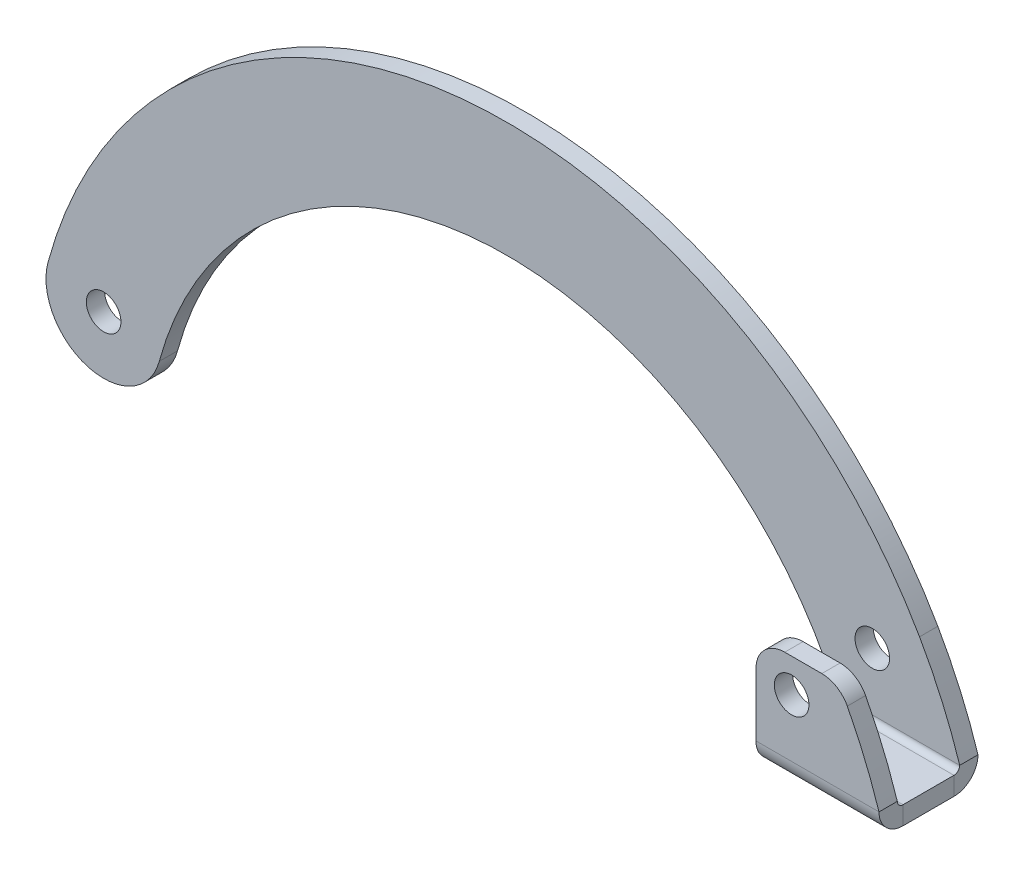
ISO-10303-21;
HEADER;
FILE_DESCRIPTION(('STEP AP214'),'2;1');
FILE_NAME('part.step','',(''),(''),'','','');
FILE_SCHEMA(('AUTOMOTIVE_DESIGN { 1 0 10303 214 1 1 1 1 }'));
ENDSEC;
DATA;
#1=APPLICATION_CONTEXT('core data for automotive mechanical design processes');
#2=APPLICATION_PROTOCOL_DEFINITION('international standard','automotive_design',2000,#1);
#3=PRODUCT_CONTEXT('',#1,'mechanical');
#4=PRODUCT('Part','Part','',(#3));
#5=PRODUCT_RELATED_PRODUCT_CATEGORY('part','',(#4));
#6=PRODUCT_DEFINITION_FORMATION('','',#4);
#7=PRODUCT_DEFINITION_CONTEXT('part definition',#1,'design');
#8=PRODUCT_DEFINITION('design','',#6,#7);
#9=PRODUCT_DEFINITION_SHAPE('','',#8);
#10=(LENGTH_UNIT() NAMED_UNIT(*) SI_UNIT(.MILLI.,.METRE.));
#11=(NAMED_UNIT(*) PLANE_ANGLE_UNIT() SI_UNIT($,.RADIAN.));
#12=(NAMED_UNIT(*) SI_UNIT($,.STERADIAN.) SOLID_ANGLE_UNIT());
#13=UNCERTAINTY_MEASURE_WITH_UNIT(LENGTH_MEASURE(1.E-05),#10,'distance_accuracy_value','');
#14=(GEOMETRIC_REPRESENTATION_CONTEXT(3) GLOBAL_UNCERTAINTY_ASSIGNED_CONTEXT((#13)) GLOBAL_UNIT_ASSIGNED_CONTEXT((#10,
#11,#12)) REPRESENTATION_CONTEXT('',''));
#15=CARTESIAN_POINT('',(0.,0.,0.));
#16=DIRECTION('',(0.,0.,1.));
#17=DIRECTION('',(1.,0.,0.));
#18=AXIS2_PLACEMENT_3D('',#15,#16,#17);
#19=CARTESIAN_POINT('',(69.9604319293642,-25.6486139166403,-3.175));
#20=DIRECTION('',(0.,0.,1.));
#21=DIRECTION('',(1.,0.,0.));
#22=AXIS2_PLACEMENT_3D('',#19,#20,#21);
#23=CYLINDRICAL_SURFACE('',#22,82.5);
#24=CARTESIAN_POINT('',(69.9604319293642,-25.6486139166403,-3.175));
#25=DIRECTION('',(0.,0.,1.));
#26=DIRECTION('',(1.,0.,0.));
#27=AXIS2_PLACEMENT_3D('',#24,#25,#26);
#28=CIRCLE('',#27,82.5);
#29=CARTESIAN_POINT('',(148.534941636826,-0.503108866392745,-3.17500000000002));
#30=VERTEX_POINT('',#29);
#31=CARTESIAN_POINT('',(141.568166957974,15.3218911336072,-3.175));
#32=VERTEX_POINT('',#31);
#33=EDGE_CURVE('E285',#30,#32,#28,.T.);
#34=ORIENTED_EDGE('',*,*,#33,.T.);
#35=DIRECTION('',(0.,0.,1.));
#36=VECTOR('',#35,1.);
#37=CARTESIAN_POINT('',(141.568166957974,15.3218911336072,-3.175));
#38=LINE('',#37,#36);
#39=CARTESIAN_POINT('',(141.568166957974,15.3218911336072,0.));
#40=VERTEX_POINT('',#39);
#41=EDGE_CURVE('E323',#32,#40,#38,.T.);
#42=ORIENTED_EDGE('',*,*,#41,.T.);
#43=CARTESIAN_POINT('',(69.9604319293642,-25.6486139166403,0.));
#44=DIRECTION('',(0.,0.,1.));
#45=DIRECTION('',(1.,0.,0.));
#46=AXIS2_PLACEMENT_3D('',#43,#44,#45);
#47=CIRCLE('',#46,82.5);
#48=CARTESIAN_POINT('',(148.534941636826,-0.503108866392727,0.));
#49=VERTEX_POINT('',#48);
#50=EDGE_CURVE('E303',#49,#40,#47,.T.);
#51=ORIENTED_EDGE('',*,*,#50,.F.);
#52=DIRECTION('',(0.,0.,1.));
#53=VECTOR('',#52,1.);
#54=CARTESIAN_POINT('',(148.534941636826,-0.503108866392727,-3.175));
#55=LINE('',#54,#53);
#56=EDGE_CURVE('E319',#30,#49,#55,.T.);
#57=ORIENTED_EDGE('',*,*,#56,.F.);
#58=EDGE_LOOP('',(#34,#42,#51,#57));
#59=FACE_BOUND('',#58,.T.);
#60=ADVANCED_FACE('F58',(#59),#23,.T.);
#61=CARTESIAN_POINT('',(148.534941636826,-4.67810886639272,0.));
#62=DIRECTION('',(1.,0.,0.));
#63=DIRECTION('',(0.,1.,0.));
#64=AXIS2_PLACEMENT_3D('',#61,#62,#63);
#65=PLANE('',#64);
#66=DIRECTION('',(0.,0.,1.));
#67=VECTOR('',#66,1.);
#68=CARTESIAN_POINT('',(148.534941636826,-1.50310886639272,0.));
#69=LINE('',#68,#67);
#70=CARTESIAN_POINT('',(148.534941636826,-1.50310886639276,9.82500000000001));
#71=VERTEX_POINT('',#70);
#72=CARTESIAN_POINT('',(148.534941636826,-1.50310886639277,0.999999999999996));
#73=VERTEX_POINT('',#72);
#74=EDGE_CURVE('E247',#71,#73,#69,.F.);
#75=ORIENTED_EDGE('',*,*,#74,.F.);
#76=DIRECTION('',(0.,-1.,0.));
#77=VECTOR('',#76,1.);
#78=CARTESIAN_POINT('',(148.534941636826,-1.50310886639276,9.82500000000001));
#79=LINE('',#78,#77);
#80=CARTESIAN_POINT('',(148.534941636826,-4.67810886639276,9.825));
#81=VERTEX_POINT('',#80);
#82=EDGE_CURVE('E222',#71,#81,#79,.T.);
#83=ORIENTED_EDGE('',*,*,#82,.T.);
#84=DIRECTION('',(0.,0.,-1.));
#85=VECTOR('',#84,1.);
#86=CARTESIAN_POINT('',(148.534941636826,-4.67810886639272,0.));
#87=LINE('',#86,#85);
#88=CARTESIAN_POINT('',(148.534941636826,-4.67810886639273,0.999999999999985));
#89=VERTEX_POINT('',#88);
#90=EDGE_CURVE('E239',#81,#89,#87,.T.);
#91=ORIENTED_EDGE('',*,*,#90,.T.);
#92=DIRECTION('',(0.,-1.,0.));
#93=VECTOR('',#92,1.);
#94=CARTESIAN_POINT('',(148.534941636826,-1.50310886639273,0.999999999999996));
#95=LINE('',#94,#93);
#96=EDGE_CURVE('E258',#73,#89,#95,.T.);
#97=ORIENTED_EDGE('',*,*,#96,.F.);
#98=EDGE_LOOP('',(#75,#83,#91,#97));
#99=FACE_BOUND('',#98,.T.);
#100=ADVANCED_FACE('F406',(#99),#65,.T.);
#101=CARTESIAN_POINT('',(0.,-4.67810886639294,0.));
#102=DIRECTION('',(0.,-1.,0.));
#103=DIRECTION('',(0.,0.,-1.));
#104=AXIS2_PLACEMENT_3D('',#101,#102,#103);
#105=PLANE('',#104);
#106=ORIENTED_EDGE('',*,*,#90,.F.);
#107=DIRECTION('',(1.,0.,0.));
#108=VECTOR('',#107,1.);
#109=CARTESIAN_POINT('',(148.534941636826,-4.67810886639276,9.825));
#110=LINE('',#109,#108);
#111=CARTESIAN_POINT('',(127.178904259268,-4.67810886639279,9.825));
#112=VERTEX_POINT('',#111);
#113=EDGE_CURVE('E185',#81,#112,#110,.F.);
#114=ORIENTED_EDGE('',*,*,#113,.T.);
#115=DIRECTION('',(0.,0.,1.));
#116=VECTOR('',#115,1.);
#117=CARTESIAN_POINT('',(127.178904259268,-4.67810886639279,10.825));
#118=LINE('',#117,#116);
#119=CARTESIAN_POINT('',(127.178904259268,-4.67810886639276,0.999999999999985));
#120=VERTEX_POINT('',#119);
#121=EDGE_CURVE('E243',#120,#112,#118,.T.);
#122=ORIENTED_EDGE('',*,*,#121,.F.);
#123=DIRECTION('',(1.,0.,0.));
#124=VECTOR('',#123,1.);
#125=CARTESIAN_POINT('',(0.,-4.67810886639294,0.999999999999988));
#126=LINE('',#125,#124);
#127=EDGE_CURVE('E254',#120,#89,#126,.T.);
#128=ORIENTED_EDGE('',*,*,#127,.T.);
#129=EDGE_LOOP('',(#106,#114,#122,#128));
#130=FACE_BOUND('',#129,.T.);
#131=ADVANCED_FACE('F413',(#130),#105,.T.);
#132=CARTESIAN_POINT('',(0.,-1.50310886639294,0.));
#133=DIRECTION('',(0.,-1.,0.));
#134=DIRECTION('',(0.,0.,-1.));
#135=AXIS2_PLACEMENT_3D('',#132,#133,#134);
#136=PLANE('',#135);
#137=DIRECTION('',(1.,0.,0.));
#138=VECTOR('',#137,1.);
#139=CARTESIAN_POINT('',(148.534941636826,-1.50310886639276,9.82500000000001));
#140=LINE('',#139,#138);
#141=CARTESIAN_POINT('',(127.178904259268,-1.50310886639279,9.82500000000001));
#142=VERTEX_POINT('',#141);
#143=EDGE_CURVE('E227',#71,#142,#140,.F.);
#144=ORIENTED_EDGE('',*,*,#143,.F.);
#145=ORIENTED_EDGE('',*,*,#74,.T.);
#146=DIRECTION('',(-1.,0.,0.));
#147=VECTOR('',#146,1.);
#148=CARTESIAN_POINT('',(127.178904259268,-1.50310886639276,0.999999999999997));
#149=LINE('',#148,#147);
#150=CARTESIAN_POINT('',(127.178904259268,-1.50310886639276,0.999999999999996));
#151=VERTEX_POINT('',#150);
#152=EDGE_CURVE('E262',#151,#73,#149,.F.);
#153=ORIENTED_EDGE('',*,*,#152,.F.);
#154=DIRECTION('',(0.,0.,-1.));
#155=VECTOR('',#154,1.);
#156=CARTESIAN_POINT('',(127.178904259268,-1.50310886639275,0.));
#157=LINE('',#156,#155);
#158=EDGE_CURVE('E250',#151,#142,#157,.F.);
#159=ORIENTED_EDGE('',*,*,#158,.T.);
#160=EDGE_LOOP('',(#144,#145,#153,#159));
#161=FACE_BOUND('',#160,.T.);
#162=ADVANCED_FACE('F460',(#161),#136,.F.);
#163=CARTESIAN_POINT('',(69.9604319293642,-25.6486139166403,-3.175));
#164=DIRECTION('',(0.,0.,1.));
#165=DIRECTION('',(1.,0.,0.));
#166=AXIS2_PLACEMENT_3D('',#163,#164,#165);
#167=CYLINDRICAL_SURFACE('',#166,62.5);
#168=CARTESIAN_POINT('',(69.9604319293642,-25.6486139166403,0.));
#169=DIRECTION('',(0.,0.,-1.));
#170=DIRECTION('',(1.,0.,0.));
#171=AXIS2_PLACEMENT_3D('',#168,#169,#170);
#172=CIRCLE('',#171,62.5);
#173=CARTESIAN_POINT('',(9.64971474887782,-9.25143753851388,0.));
#174=VERTEX_POINT('',#173);
#175=CARTESIAN_POINT('',(127.178904259268,-0.503108866392758,0.));
#176=VERTEX_POINT('',#175);
#177=EDGE_CURVE('E311',#174,#176,#172,.T.);
#178=ORIENTED_EDGE('',*,*,#177,.F.);
#179=DIRECTION('',(0.,0.,1.));
#180=VECTOR('',#179,1.);
#181=CARTESIAN_POINT('',(9.64971474887782,-9.25143753851388,-3.175));
#182=LINE('',#181,#180);
#183=CARTESIAN_POINT('',(9.64971474887782,-9.25143753851388,-3.175));
#184=VERTEX_POINT('',#183);
#185=EDGE_CURVE('E327',#184,#174,#182,.T.);
#186=ORIENTED_EDGE('',*,*,#185,.F.);
#187=CARTESIAN_POINT('',(69.9604319293642,-25.6486139166403,-3.175));
#188=DIRECTION('',(0.,0.,-1.));
#189=DIRECTION('',(1.,0.,0.));
#190=AXIS2_PLACEMENT_3D('',#187,#188,#189);
#191=CIRCLE('',#190,62.5);
#192=CARTESIAN_POINT('',(127.178904259268,-0.503108866392758,-3.175));
#193=VERTEX_POINT('',#192);
#194=EDGE_CURVE('E294',#184,#193,#191,.T.);
#195=ORIENTED_EDGE('',*,*,#194,.T.);
#196=DIRECTION('',(0.,0.,1.));
#197=VECTOR('',#196,1.);
#198=CARTESIAN_POINT('',(127.178904259268,-0.503108866392758,-3.175));
#199=LINE('',#198,#197);
#200=EDGE_CURVE('E324',#193,#176,#199,.T.);
#201=ORIENTED_EDGE('',*,*,#200,.T.);
#202=EDGE_LOOP('',(#178,#186,#195,#201));
#203=FACE_BOUND('',#202,.T.);
#204=ADVANCED_FACE('F428',(#203),#167,.F.);
#205=CARTESIAN_POINT('',(0.,-6.62788931801365,-3.175));
#206=DIRECTION('',(0.,0.,1.));
#207=DIRECTION('',(1.,0.,0.));
#208=AXIS2_PLACEMENT_3D('',#205,#206,#207);
#209=CYLINDRICAL_SURFACE('',#208,10.);
#210=CARTESIAN_POINT('',(0.,-6.62788931801365,0.));
#211=DIRECTION('',(0.,0.,1.));
#212=DIRECTION('',(1.,0.,0.));
#213=AXIS2_PLACEMENT_3D('',#210,#211,#212);
#214=CIRCLE('',#213,10.);
#215=CARTESIAN_POINT('',(-9.64971474887784,-4.00434109751343,0.));
#216=VERTEX_POINT('',#215);
#217=EDGE_CURVE('E307',#216,#174,#214,.T.);
#218=ORIENTED_EDGE('',*,*,#217,.F.);
#219=DIRECTION('',(0.,0.,1.));
#220=VECTOR('',#219,1.);
#221=CARTESIAN_POINT('',(-9.64971474887784,-4.00434109751343,-3.175));
#222=LINE('',#221,#220);
#223=CARTESIAN_POINT('',(-9.64971474887784,-4.00434109751343,-3.175));
#224=VERTEX_POINT('',#223);
#225=EDGE_CURVE('E302',#224,#216,#222,.T.);
#226=ORIENTED_EDGE('',*,*,#225,.F.);
#227=CARTESIAN_POINT('',(0.,-6.62788931801365,-3.175));
#228=DIRECTION('',(0.,0.,1.));
#229=DIRECTION('',(1.,0.,0.));
#230=AXIS2_PLACEMENT_3D('',#227,#228,#229);
#231=CIRCLE('',#230,10.);
#232=EDGE_CURVE('E289',#224,#184,#231,.T.);
#233=ORIENTED_EDGE('',*,*,#232,.T.);
#234=ORIENTED_EDGE('',*,*,#185,.T.);
#235=EDGE_LOOP('',(#218,#226,#233,#234));
#236=FACE_BOUND('',#235,.T.);
#237=ADVANCED_FACE('F419',(#236),#209,.T.);
#238=ORIENTED_EDGE('',*,*,#41,.F.);
#239=EDGE_CURVE('E290',#32,#224,#28,.T.);
#240=ORIENTED_EDGE('',*,*,#239,.T.);
#241=ORIENTED_EDGE('',*,*,#225,.T.);
#242=EDGE_CURVE('E273',#40,#216,#47,.T.);
#243=ORIENTED_EDGE('',*,*,#242,.F.);
#244=EDGE_LOOP('',(#238,#240,#241,#243));
#245=FACE_BOUND('',#244,.T.);
#246=ADVANCED_FACE('F409',(#245),#23,.T.);
#247=CARTESIAN_POINT('',(69.9604319293642,-25.6486139166403,-3.175));
#248=DIRECTION('',(0.,0.,1.));
#249=DIRECTION('',(1.,0.,0.));
#250=AXIS2_PLACEMENT_3D('',#247,#248,#249);
#251=PLANE('',#250);
#252=CARTESIAN_POINT('',(0.,-6.62788931801365,-3.17500000000002));
#253=DIRECTION('',(0.,0.,1.));
#254=DIRECTION('',(1.,0.,0.));
#255=AXIS2_PLACEMENT_3D('',#252,#253,#254);
#256=CIRCLE('',#255,3.);
#257=CARTESIAN_POINT('',(3.,-6.62788931801365,-3.17500000000002));
#258=VERTEX_POINT('',#257);
#259=EDGE_CURVE('E175',#258,#258,#256,.T.);
#260=ORIENTED_EDGE('',*,*,#259,.T.);
#261=EDGE_LOOP('',(#260));
#262=FACE_BOUND('',#261,.T.);
#263=CARTESIAN_POINT('',(133.372130177897,9.49689113360727,-3.17500000000002));
#264=DIRECTION('',(0.,0.,1.));
#265=DIRECTION('',(1.,0.,0.));
#266=AXIS2_PLACEMENT_3D('',#263,#264,#265);
#267=CIRCLE('',#266,2.99999999999999);
#268=CARTESIAN_POINT('',(136.372130177897,9.49689113360727,-3.17500000000002));
#269=VERTEX_POINT('',#268);
#270=EDGE_CURVE('E374',#269,#269,#267,.T.);
#271=ORIENTED_EDGE('',*,*,#270,.T.);
#272=EDGE_LOOP('',(#271));
#273=FACE_BOUND('',#272,.T.);
#274=ORIENTED_EDGE('',*,*,#33,.F.);
#275=DIRECTION('',(1.,0.,0.));
#276=VECTOR('',#275,1.);
#277=CARTESIAN_POINT('',(127.178904259268,-0.503108866392751,-3.175));
#278=LINE('',#277,#276);
#279=EDGE_CURVE('E298',#193,#30,#278,.T.);
#280=ORIENTED_EDGE('',*,*,#279,.F.);
#281=ORIENTED_EDGE('',*,*,#194,.F.);
#282=ORIENTED_EDGE('',*,*,#232,.F.);
#283=ORIENTED_EDGE('',*,*,#239,.F.);
#284=EDGE_LOOP('',(#274,#280,#281,#282,#283));
#285=FACE_BOUND('',#284,.T.);
#286=ADVANCED_FACE('F418',(#262,#273,#285),#251,.F.);
#287=CARTESIAN_POINT('',(69.9604319293642,-25.6486139166403,0.));
#288=DIRECTION('',(0.,0.,1.));
#289=DIRECTION('',(1.,0.,0.));
#290=AXIS2_PLACEMENT_3D('',#287,#288,#289);
#291=PLANE('',#290);
#292=CARTESIAN_POINT('',(0.,-6.62788931801365,0.));
#293=DIRECTION('',(0.,0.,1.));
#294=DIRECTION('',(1.,0.,0.));
#295=AXIS2_PLACEMENT_3D('',#292,#293,#294);
#296=CIRCLE('',#295,3.);
#297=CARTESIAN_POINT('',(3.,-6.62788931801365,0.));
#298=VERTEX_POINT('',#297);
#299=EDGE_CURVE('E339',#298,#298,#296,.T.);
#300=ORIENTED_EDGE('',*,*,#299,.F.);
#301=EDGE_LOOP('',(#300));
#302=FACE_BOUND('',#301,.T.);
#303=CARTESIAN_POINT('',(133.372130177897,9.49689113360727,0.));
#304=DIRECTION('',(0.,0.,1.));
#305=DIRECTION('',(1.,0.,0.));
#306=AXIS2_PLACEMENT_3D('',#303,#304,#305);
#307=CIRCLE('',#306,2.99999999999999);
#308=CARTESIAN_POINT('',(136.372130177897,9.49689113360727,0.));
#309=VERTEX_POINT('',#308);
#310=EDGE_CURVE('E337',#309,#309,#307,.T.);
#311=ORIENTED_EDGE('',*,*,#310,.F.);
#312=EDGE_LOOP('',(#311));
#313=FACE_BOUND('',#312,.T.);
#314=DIRECTION('',(1.,0.,0.));
#315=VECTOR('',#314,1.);
#316=CARTESIAN_POINT('',(143.372130177897,-0.503108866392726,0.));
#317=LINE('',#316,#315);
#318=EDGE_CURVE('E315',#176,#49,#317,.T.);
#319=ORIENTED_EDGE('',*,*,#318,.T.);
#320=ORIENTED_EDGE('',*,*,#50,.T.);
#321=ORIENTED_EDGE('',*,*,#242,.T.);
#322=ORIENTED_EDGE('',*,*,#217,.T.);
#323=ORIENTED_EDGE('',*,*,#177,.T.);
#324=EDGE_LOOP('',(#319,#320,#321,#322,#323));
#325=FACE_BOUND('',#324,.T.);
#326=ADVANCED_FACE('F425',(#302,#313,#325),#291,.T.);
#327=CARTESIAN_POINT('',(127.178904259268,-0.503108866392739,1.));
#328=DIRECTION('',(-1.,0.,0.));
#329=DIRECTION('',(0.,-1.,0.));
#330=AXIS2_PLACEMENT_3D('',#327,#328,#329);
#331=PLANE('',#330);
#332=DIRECTION('',(0.,-1.,0.));
#333=VECTOR('',#332,1.);
#334=CARTESIAN_POINT('',(127.178904259268,-4.67810886639276,0.999999999999987));
#335=LINE('',#334,#333);
#336=EDGE_CURVE('E236',#151,#120,#335,.T.);
#337=ORIENTED_EDGE('',*,*,#336,.F.);
#338=CARTESIAN_POINT('',(127.178904259268,-0.503108866392739,1.));
#339=DIRECTION('',(1.,0.,0.));
#340=DIRECTION('',(0.,1.,0.));
#341=AXIS2_PLACEMENT_3D('',#338,#339,#340);
#342=CIRCLE('',#341,1.00000000000002);
#343=EDGE_CURVE('E278',#176,#151,#342,.F.);
#344=ORIENTED_EDGE('',*,*,#343,.F.);
#345=ORIENTED_EDGE('',*,*,#200,.F.);
#346=CARTESIAN_POINT('',(127.178904259268,-0.503108866392739,1.));
#347=DIRECTION('',(1.,0.,0.));
#348=DIRECTION('',(0.,1.,0.));
#349=AXIS2_PLACEMENT_3D('',#346,#347,#348);
#350=CIRCLE('',#349,4.17500000000002);
#351=EDGE_CURVE('E269',#193,#120,#350,.F.);
#352=ORIENTED_EDGE('',*,*,#351,.T.);
#353=EDGE_LOOP('',(#337,#344,#345,#352));
#354=FACE_BOUND('',#353,.T.);
#355=ADVANCED_FACE('F452',(#354),#331,.T.);
#356=CARTESIAN_POINT('',(148.534941636826,-0.503108866392746,1.));
#357=DIRECTION('',(-1.,0.,0.));
#358=DIRECTION('',(0.,-1.,0.));
#359=AXIS2_PLACEMENT_3D('',#356,#357,#358);
#360=PLANE('',#359);
#361=CARTESIAN_POINT('',(148.534941636826,-0.503108866392746,1.));
#362=DIRECTION('',(1.,0.,0.));
#363=DIRECTION('',(0.,1.,0.));
#364=AXIS2_PLACEMENT_3D('',#361,#362,#363);
#365=CIRCLE('',#364,1.00000000000002);
#366=EDGE_CURVE('E242',#73,#49,#365,.T.);
#367=ORIENTED_EDGE('',*,*,#366,.F.);
#368=ORIENTED_EDGE('',*,*,#96,.T.);
#369=CARTESIAN_POINT('',(148.534941636826,-0.503108866392746,1.));
#370=DIRECTION('',(1.,0.,0.));
#371=DIRECTION('',(0.,1.,0.));
#372=AXIS2_PLACEMENT_3D('',#369,#370,#371);
#373=CIRCLE('',#372,4.17500000000002);
#374=EDGE_CURVE('E274',#89,#30,#373,.T.);
#375=ORIENTED_EDGE('',*,*,#374,.T.);
#376=ORIENTED_EDGE('',*,*,#56,.T.);
#377=EDGE_LOOP('',(#367,#368,#375,#376));
#378=FACE_BOUND('',#377,.T.);
#379=ADVANCED_FACE('F444',(#378),#360,.F.);
#380=CARTESIAN_POINT('',(148.534941636826,-0.503108866392746,1.));
#381=DIRECTION('',(1.,0.,0.));
#382=DIRECTION('',(0.,-1.,0.));
#383=AXIS2_PLACEMENT_3D('',#380,#381,#382);
#384=CYLINDRICAL_SURFACE('',#383,4.17500000000002);
#385=ORIENTED_EDGE('',*,*,#279,.T.);
#386=ORIENTED_EDGE('',*,*,#374,.F.);
#387=ORIENTED_EDGE('',*,*,#127,.F.);
#388=ORIENTED_EDGE('',*,*,#351,.F.);
#389=EDGE_LOOP('',(#385,#386,#387,#388));
#390=FACE_BOUND('',#389,.T.);
#391=ADVANCED_FACE('F443',(#390),#384,.T.);
#392=CARTESIAN_POINT('',(148.534941636826,-0.503108866392746,1.));
#393=DIRECTION('',(1.,0.,0.));
#394=DIRECTION('',(0.,-1.,0.));
#395=AXIS2_PLACEMENT_3D('',#392,#393,#394);
#396=CYLINDRICAL_SURFACE('',#395,1.00000000000002);
#397=ORIENTED_EDGE('',*,*,#318,.F.);
#398=ORIENTED_EDGE('',*,*,#343,.T.);
#399=ORIENTED_EDGE('',*,*,#152,.T.);
#400=ORIENTED_EDGE('',*,*,#366,.T.);
#401=EDGE_LOOP('',(#397,#398,#399,#400));
#402=FACE_BOUND('',#401,.T.);
#403=ADVANCED_FACE('F463',(#402),#396,.F.);
#404=CARTESIAN_POINT('',(127.178904259268,-4.67810886639279,10.825));
#405=DIRECTION('',(-1.,0.,0.));
#406=DIRECTION('',(0.,-1.,0.));
#407=AXIS2_PLACEMENT_3D('',#404,#405,#406);
#408=PLANE('',#407);
#409=DIRECTION('',(0.,-1.,0.));
#410=VECTOR('',#409,1.);
#411=CARTESIAN_POINT('',(127.178904259268,-1.50310886639279,9.82500000000001));
#412=LINE('',#411,#410);
#413=EDGE_CURVE('E232',#142,#112,#412,.T.);
#414=ORIENTED_EDGE('',*,*,#413,.F.);
#415=ORIENTED_EDGE('',*,*,#158,.F.);
#416=ORIENTED_EDGE('',*,*,#336,.T.);
#417=ORIENTED_EDGE('',*,*,#121,.T.);
#418=EDGE_LOOP('',(#414,#415,#416,#417));
#419=FACE_BOUND('',#418,.T.);
#420=ADVANCED_FACE('F457',(#419),#408,.T.);
#421=CARTESIAN_POINT('',(127.178904259268,-0.503108866392794,9.82500000000001));
#422=DIRECTION('',(-1.,0.,0.));
#423=DIRECTION('',(0.,-1.,0.));
#424=AXIS2_PLACEMENT_3D('',#421,#422,#423);
#425=PLANE('',#424);
#426=DIRECTION('',(0.,0.,1.));
#427=VECTOR('',#426,1.);
#428=CARTESIAN_POINT('',(127.178904259268,-0.503108866392795,10.825));
#429=LINE('',#428,#427);
#430=CARTESIAN_POINT('',(127.178904259268,-0.503108866392794,10.825));
#431=VERTEX_POINT('',#430);
#432=CARTESIAN_POINT('',(127.178904259268,-0.503108866392794,14.));
#433=VERTEX_POINT('',#432);
#434=EDGE_CURVE('E209',#431,#433,#429,.T.);
#435=ORIENTED_EDGE('',*,*,#434,.F.);
#436=CARTESIAN_POINT('',(127.178904259268,-0.503108866392794,9.82500000000001));
#437=DIRECTION('',(1.,0.,0.));
#438=DIRECTION('',(0.,1.,0.));
#439=AXIS2_PLACEMENT_3D('',#436,#437,#438);
#440=CIRCLE('',#439,0.999999999999997);
#441=EDGE_CURVE('E189',#142,#431,#440,.F.);
#442=ORIENTED_EDGE('',*,*,#441,.F.);
#443=ORIENTED_EDGE('',*,*,#413,.T.);
#444=CARTESIAN_POINT('',(127.178904259268,-0.503108866392794,9.82500000000001));
#445=DIRECTION('',(1.,0.,0.));
#446=DIRECTION('',(0.,1.,0.));
#447=AXIS2_PLACEMENT_3D('',#444,#445,#446);
#448=CIRCLE('',#447,4.175);
#449=EDGE_CURVE('E220',#112,#433,#448,.F.);
#450=ORIENTED_EDGE('',*,*,#449,.T.);
#451=EDGE_LOOP('',(#435,#442,#443,#450));
#452=FACE_BOUND('',#451,.T.);
#453=ADVANCED_FACE('F396',(#452),#425,.T.);
#454=CARTESIAN_POINT('',(148.534941636826,-0.503108866392764,9.82500000000001));
#455=DIRECTION('',(-1.,0.,0.));
#456=DIRECTION('',(0.,-1.,0.));
#457=AXIS2_PLACEMENT_3D('',#454,#455,#456);
#458=PLANE('',#457);
#459=CARTESIAN_POINT('',(148.534941636826,-0.503108866392764,9.82500000000001));
#460=DIRECTION('',(1.,0.,0.));
#461=DIRECTION('',(0.,1.,0.));
#462=AXIS2_PLACEMENT_3D('',#459,#460,#461);
#463=CIRCLE('',#462,0.999999999999997);
#464=CARTESIAN_POINT('',(148.534941636826,-0.503108866392724,10.825));
#465=VERTEX_POINT('',#464);
#466=EDGE_CURVE('E194',#465,#71,#463,.T.);
#467=ORIENTED_EDGE('',*,*,#466,.F.);
#468=DIRECTION('',(0.,0.,1.));
#469=VECTOR('',#468,1.);
#470=CARTESIAN_POINT('',(148.534941636826,-0.503108866392763,10.825));
#471=LINE('',#470,#469);
#472=CARTESIAN_POINT('',(148.534941636826,-0.503108866392724,14.));
#473=VERTEX_POINT('',#472);
#474=EDGE_CURVE('E170',#465,#473,#471,.T.);
#475=ORIENTED_EDGE('',*,*,#474,.T.);
#476=CARTESIAN_POINT('',(148.534941636826,-0.503108866392764,9.82500000000001));
#477=DIRECTION('',(1.,0.,0.));
#478=DIRECTION('',(0.,1.,0.));
#479=AXIS2_PLACEMENT_3D('',#476,#477,#478);
#480=CIRCLE('',#479,4.175);
#481=EDGE_CURVE('E180',#473,#81,#480,.T.);
#482=ORIENTED_EDGE('',*,*,#481,.T.);
#483=ORIENTED_EDGE('',*,*,#82,.F.);
#484=EDGE_LOOP('',(#467,#475,#482,#483));
#485=FACE_BOUND('',#484,.T.);
#486=ADVANCED_FACE('F192',(#485),#458,.F.);
#487=CARTESIAN_POINT('',(148.534941636826,-0.503108866392764,9.82500000000001));
#488=DIRECTION('',(1.,0.,0.));
#489=DIRECTION('',(0.,0.,1.));
#490=AXIS2_PLACEMENT_3D('',#487,#488,#489);
#491=CYLINDRICAL_SURFACE('',#490,4.175);
#492=ORIENTED_EDGE('',*,*,#113,.F.);
#493=ORIENTED_EDGE('',*,*,#481,.F.);
#494=DIRECTION('',(1.,0.,0.));
#495=VECTOR('',#494,1.);
#496=CARTESIAN_POINT('',(0.,-0.503108866392981,14.));
#497=LINE('',#496,#495);
#498=EDGE_CURVE('E182',#433,#473,#497,.T.);
#499=ORIENTED_EDGE('',*,*,#498,.F.);
#500=ORIENTED_EDGE('',*,*,#449,.F.);
#501=EDGE_LOOP('',(#492,#493,#499,#500));
#502=FACE_BOUND('',#501,.T.);
#503=ADVANCED_FACE('F181',(#502),#491,.T.);
#504=CARTESIAN_POINT('',(148.534941636826,-0.503108866392764,9.82500000000001));
#505=DIRECTION('',(1.,0.,0.));
#506=DIRECTION('',(0.,0.,1.));
#507=AXIS2_PLACEMENT_3D('',#504,#505,#506);
#508=CYLINDRICAL_SURFACE('',#507,0.999999999999997);
#509=ORIENTED_EDGE('',*,*,#143,.T.);
#510=ORIENTED_EDGE('',*,*,#441,.T.);
#511=DIRECTION('',(1.,0.,0.));
#512=VECTOR('',#511,1.);
#513=CARTESIAN_POINT('',(127.178904259268,-0.503108866392795,10.825));
#514=LINE('',#513,#512);
#515=EDGE_CURVE('E196',#431,#465,#514,.T.);
#516=ORIENTED_EDGE('',*,*,#515,.T.);
#517=ORIENTED_EDGE('',*,*,#466,.T.);
#518=EDGE_LOOP('',(#509,#510,#516,#517));
#519=FACE_BOUND('',#518,.T.);
#520=ADVANCED_FACE('F397',(#519),#508,.F.);
#521=CARTESIAN_POINT('',(127.178904259268,15.321891133607,14.));
#522=DIRECTION('',(1.,0.,0.));
#523=DIRECTION('',(0.,1.,0.));
#524=AXIS2_PLACEMENT_3D('',#521,#522,#523);
#525=PLANE('',#524);
#526=DIRECTION('',(0.,-1.,0.));
#527=VECTOR('',#526,1.);
#528=CARTESIAN_POINT('',(127.178904259268,15.321891133607,14.));
#529=LINE('',#528,#527);
#530=CARTESIAN_POINT('',(127.178904259268,10.3218911336071,14.));
#531=VERTEX_POINT('',#530);
#532=EDGE_CURVE('E200',#531,#433,#529,.T.);
#533=ORIENTED_EDGE('',*,*,#532,.F.);
#534=DIRECTION('',(0.,0.,-1.));
#535=VECTOR('',#534,1.);
#536=CARTESIAN_POINT('',(127.178904259268,10.3218911336071,14.));
#537=LINE('',#536,#535);
#538=CARTESIAN_POINT('',(127.178904259268,10.3218911336071,10.825));
#539=VERTEX_POINT('',#538);
#540=EDGE_CURVE('E13',#531,#539,#537,.T.);
#541=ORIENTED_EDGE('',*,*,#540,.T.);
#542=DIRECTION('',(0.,-1.,0.));
#543=VECTOR('',#542,1.);
#544=CARTESIAN_POINT('',(127.178904259268,15.321891133607,10.825));
#545=LINE('',#544,#543);
#546=EDGE_CURVE('E202',#539,#431,#545,.T.);
#547=ORIENTED_EDGE('',*,*,#546,.T.);
#548=ORIENTED_EDGE('',*,*,#434,.T.);
#549=EDGE_LOOP('',(#533,#541,#547,#548));
#550=FACE_BOUND('',#549,.T.);
#551=ADVANCED_FACE('F391',(#550),#525,.F.);
#552=CARTESIAN_POINT('',(0.,0.,14.));
#553=DIRECTION('',(0.,0.,1.));
#554=DIRECTION('',(1.,0.,0.));
#555=AXIS2_PLACEMENT_3D('',#552,#553,#554);
#556=PLANE('',#555);
#557=CARTESIAN_POINT('',(69.9604319293642,-25.6486139166403,14.));
#558=DIRECTION('',(0.,0.,-1.));
#559=DIRECTION('',(1.,0.,0.));
#560=AXIS2_PLACEMENT_3D('',#557,#558,#559);
#561=CIRCLE('',#560,82.5);
#562=CARTESIAN_POINT('',(143.03597722413,12.6425688787843,14.));
#563=VERTEX_POINT('',#562);
#564=EDGE_CURVE('E166',#563,#473,#561,.T.);
#565=ORIENTED_EDGE('',*,*,#564,.F.);
#566=CARTESIAN_POINT('',(138.607156297175,10.321891133607,14.));
#567=DIRECTION('',(0.,0.,1.));
#568=DIRECTION('',(1.,0.,0.));
#569=AXIS2_PLACEMENT_3D('',#566,#567,#568);
#570=CIRCLE('',#569,5.);
#571=CARTESIAN_POINT('',(138.607156297175,15.321891133607,14.));
#572=VERTEX_POINT('',#571);
#573=EDGE_CURVE('E67',#563,#572,#570,.T.);
#574=ORIENTED_EDGE('',*,*,#573,.T.);
#575=DIRECTION('',(-1.,0.,0.));
#576=VECTOR('',#575,1.);
#577=CARTESIAN_POINT('',(148.534941636826,15.321891133607,14.));
#578=LINE('',#577,#576);
#579=CARTESIAN_POINT('',(132.178904259268,15.321891133607,14.));
#580=VERTEX_POINT('',#579);
#581=EDGE_CURVE('E212',#572,#580,#578,.T.);
#582=ORIENTED_EDGE('',*,*,#581,.T.);
#583=CARTESIAN_POINT('',(132.178904259268,10.321891133607,14.));
#584=DIRECTION('',(0.,0.,1.));
#585=DIRECTION('',(1.,0.,0.));
#586=AXIS2_PLACEMENT_3D('',#583,#584,#585);
#587=CIRCLE('',#586,5.);
#588=EDGE_CURVE('E74',#580,#531,#587,.T.);
#589=ORIENTED_EDGE('',*,*,#588,.T.);
#590=ORIENTED_EDGE('',*,*,#532,.T.);
#591=ORIENTED_EDGE('',*,*,#498,.T.);
#592=EDGE_LOOP('',(#565,#574,#582,#589,#590,#591));
#593=FACE_BOUND('',#592,.T.);
#594=CARTESIAN_POINT('',(133.372130177897,9.49689113360727,14.));
#595=DIRECTION('',(0.,0.,1.));
#596=DIRECTION('',(1.,0.,0.));
#597=AXIS2_PLACEMENT_3D('',#594,#595,#596);
#598=CIRCLE('',#597,2.99999999999999);
#599=CARTESIAN_POINT('',(136.372130177897,9.49689113360727,14.));
#600=VERTEX_POINT('',#599);
#601=EDGE_CURVE('E378',#600,#600,#598,.T.);
#602=ORIENTED_EDGE('',*,*,#601,.F.);
#603=EDGE_LOOP('',(#602));
#604=FACE_BOUND('',#603,.T.);
#605=ADVANCED_FACE('F198',(#593,#604),#556,.T.);
#606=CARTESIAN_POINT('',(0.,0.,10.825));
#607=DIRECTION('',(0.,0.,1.));
#608=DIRECTION('',(1.,0.,0.));
#609=AXIS2_PLACEMENT_3D('',#606,#607,#608);
#610=PLANE('',#609);
#611=CARTESIAN_POINT('',(133.372130177897,9.49689113360727,10.825));
#612=DIRECTION('',(0.,0.,1.));
#613=DIRECTION('',(1.,0.,0.));
#614=AXIS2_PLACEMENT_3D('',#611,#612,#613);
#615=CIRCLE('',#614,2.99999999999999);
#616=CARTESIAN_POINT('',(136.372130177897,9.49689113360727,10.825));
#617=VERTEX_POINT('',#616);
#618=EDGE_CURVE('E333',#617,#617,#615,.T.);
#619=ORIENTED_EDGE('',*,*,#618,.T.);
#620=EDGE_LOOP('',(#619));
#621=FACE_BOUND('',#620,.T.);
#622=DIRECTION('',(-1.,0.,0.));
#623=VECTOR('',#622,1.);
#624=CARTESIAN_POINT('',(148.534941636826,15.321891133607,10.825));
#625=LINE('',#624,#623);
#626=CARTESIAN_POINT('',(138.607156297175,15.321891133607,10.825));
#627=VERTEX_POINT('',#626);
#628=CARTESIAN_POINT('',(132.178904259268,15.321891133607,10.825));
#629=VERTEX_POINT('',#628);
#630=EDGE_CURVE('E205',#627,#629,#625,.T.);
#631=ORIENTED_EDGE('',*,*,#630,.F.);
#632=CARTESIAN_POINT('',(138.607156297175,10.321891133607,10.825));
#633=DIRECTION('',(0.,0.,1.));
#634=DIRECTION('',(1.,0.,0.));
#635=AXIS2_PLACEMENT_3D('',#632,#633,#634);
#636=CIRCLE('',#635,5.);
#637=CARTESIAN_POINT('',(143.03597722413,12.6425688787843,10.825));
#638=VERTEX_POINT('',#637);
#639=EDGE_CURVE('E355',#627,#638,#636,.F.);
#640=ORIENTED_EDGE('',*,*,#639,.T.);
#641=CARTESIAN_POINT('',(69.9604319293642,-25.6486139166403,10.825));
#642=DIRECTION('',(0.,0.,1.));
#643=DIRECTION('',(1.,0.,0.));
#644=AXIS2_PLACEMENT_3D('',#641,#642,#643);
#645=CIRCLE('',#644,82.5);
#646=EDGE_CURVE('E338',#638,#465,#645,.F.);
#647=ORIENTED_EDGE('',*,*,#646,.T.);
#648=ORIENTED_EDGE('',*,*,#515,.F.);
#649=ORIENTED_EDGE('',*,*,#546,.F.);
#650=CARTESIAN_POINT('',(132.178904259268,10.321891133607,10.825));
#651=DIRECTION('',(0.,0.,1.));
#652=DIRECTION('',(1.,0.,0.));
#653=AXIS2_PLACEMENT_3D('',#650,#651,#652);
#654=CIRCLE('',#653,5.);
#655=EDGE_CURVE('E352',#539,#629,#654,.F.);
#656=ORIENTED_EDGE('',*,*,#655,.T.);
#657=EDGE_LOOP('',(#631,#640,#647,#648,#649,#656));
#658=FACE_BOUND('',#657,.T.);
#659=ADVANCED_FACE('F371',(#621,#658),#610,.F.);
#660=CARTESIAN_POINT('',(148.534941636826,15.321891133607,14.));
#661=DIRECTION('',(0.,-1.,0.));
#662=DIRECTION('',(0.,0.,-1.));
#663=AXIS2_PLACEMENT_3D('',#660,#661,#662);
#664=PLANE('',#663);
#665=ORIENTED_EDGE('',*,*,#581,.F.);
#666=DIRECTION('',(0.,0.,1.));
#667=VECTOR('',#666,1.);
#668=CARTESIAN_POINT('',(138.607156297175,15.321891133607,14.));
#669=LINE('',#668,#667);
#670=EDGE_CURVE('E348',#572,#627,#669,.F.);
#671=ORIENTED_EDGE('',*,*,#670,.T.);
#672=ORIENTED_EDGE('',*,*,#630,.T.);
#673=DIRECTION('',(0.,0.,-1.));
#674=VECTOR('',#673,1.);
#675=CARTESIAN_POINT('',(132.178904259268,15.321891133607,14.));
#676=LINE('',#675,#674);
#677=EDGE_CURVE('E345',#629,#580,#676,.F.);
#678=ORIENTED_EDGE('',*,*,#677,.T.);
#679=EDGE_LOOP('',(#665,#671,#672,#678));
#680=FACE_BOUND('',#679,.T.);
#681=ADVANCED_FACE('F366',(#680),#664,.F.);
#682=CARTESIAN_POINT('',(69.9604319293642,-25.6486139166403,-3.17500000000002));
#683=DIRECTION('',(0.,0.,1.));
#684=DIRECTION('',(1.,0.,0.));
#685=AXIS2_PLACEMENT_3D('',#682,#683,#684);
#686=CYLINDRICAL_SURFACE('',#685,82.5);
#687=ORIENTED_EDGE('',*,*,#646,.F.);
#688=DIRECTION('',(0.,0.,1.));
#689=VECTOR('',#688,1.);
#690=CARTESIAN_POINT('',(143.03597722413,12.6425688787843,-3.17500000000002));
#691=LINE('',#690,#689);
#692=EDGE_CURVE('E82',#638,#563,#691,.T.);
#693=ORIENTED_EDGE('',*,*,#692,.T.);
#694=ORIENTED_EDGE('',*,*,#564,.T.);
#695=ORIENTED_EDGE('',*,*,#474,.F.);
#696=EDGE_LOOP('',(#687,#693,#694,#695));
#697=FACE_BOUND('',#696,.T.);
#698=ADVANCED_FACE('F168',(#697),#686,.T.);
#699=CARTESIAN_POINT('',(133.372130177897,9.49689113360727,-3.17500000000002));
#700=DIRECTION('',(0.,0.,1.));
#701=DIRECTION('',(1.,0.,0.));
#702=AXIS2_PLACEMENT_3D('',#699,#700,#701);
#703=CYLINDRICAL_SURFACE('',#702,2.99999999999999);
#704=ORIENTED_EDGE('',*,*,#601,.T.);
#705=EDGE_LOOP('',(#704));
#706=FACE_BOUND('',#705,.T.);
#707=ORIENTED_EDGE('',*,*,#618,.F.);
#708=EDGE_LOOP('',(#707));
#709=FACE_BOUND('',#708,.T.);
#710=ADVANCED_FACE('F510',(#706,#709),#703,.F.);
#711=ORIENTED_EDGE('',*,*,#310,.T.);
#712=EDGE_LOOP('',(#711));
#713=FACE_BOUND('',#712,.T.);
#714=ORIENTED_EDGE('',*,*,#270,.F.);
#715=EDGE_LOOP('',(#714));
#716=FACE_BOUND('',#715,.T.);
#717=ADVANCED_FACE('F507',(#713,#716),#703,.F.);
#718=CARTESIAN_POINT('',(0.,-6.62788931801365,-3.17500000000002));
#719=DIRECTION('',(0.,0.,1.));
#720=DIRECTION('',(1.,0.,0.));
#721=AXIS2_PLACEMENT_3D('',#718,#719,#720);
#722=CYLINDRICAL_SURFACE('',#721,3.);
#723=ORIENTED_EDGE('',*,*,#299,.T.);
#724=EDGE_LOOP('',(#723));
#725=FACE_BOUND('',#724,.T.);
#726=ORIENTED_EDGE('',*,*,#259,.F.);
#727=EDGE_LOOP('',(#726));
#728=FACE_BOUND('',#727,.T.);
#729=ADVANCED_FACE('F404',(#725,#728),#722,.F.);
#730=CARTESIAN_POINT('',(138.607156297175,10.321891133607,-3.17500000000002));
#731=DIRECTION('',(0.,0.,1.));
#732=DIRECTION('',(1.,0.,0.));
#733=AXIS2_PLACEMENT_3D('',#730,#731,#732);
#734=CYLINDRICAL_SURFACE('',#733,5.);
#735=ORIENTED_EDGE('',*,*,#573,.F.);
#736=ORIENTED_EDGE('',*,*,#692,.F.);
#737=ORIENTED_EDGE('',*,*,#639,.F.);
#738=ORIENTED_EDGE('',*,*,#670,.F.);
#739=EDGE_LOOP('',(#735,#736,#737,#738));
#740=FACE_BOUND('',#739,.T.);
#741=ADVANCED_FACE('F369',(#740),#734,.T.);
#742=CARTESIAN_POINT('',(132.178904259268,10.321891133607,14.));
#743=DIRECTION('',(0.,0.,-1.));
#744=DIRECTION('',(-1.,0.,0.));
#745=AXIS2_PLACEMENT_3D('',#742,#743,#744);
#746=CYLINDRICAL_SURFACE('',#745,5.);
#747=ORIENTED_EDGE('',*,*,#588,.F.);
#748=ORIENTED_EDGE('',*,*,#677,.F.);
#749=ORIENTED_EDGE('',*,*,#655,.F.);
#750=ORIENTED_EDGE('',*,*,#540,.F.);
#751=EDGE_LOOP('',(#747,#748,#749,#750));
#752=FACE_BOUND('',#751,.T.);
#753=ADVANCED_FACE('F60',(#752),#746,.T.);
#754=CLOSED_SHELL('',(#60,#100,#131,#162,#204,#237,#246,#286,#326,#355,#379,#391,#403,#420,#453,
#486,#503,#520,#551,#605,#659,#681,#698,#710,#717,#729,#741,#753));
#755=MANIFOLD_SOLID_BREP('B2',#754);
#756=ADVANCED_BREP_SHAPE_REPRESENTATION('',(#18,#755),#14);
#757=SHAPE_DEFINITION_REPRESENTATION(#9,#756);
ENDSEC;
END-ISO-10303-21;
